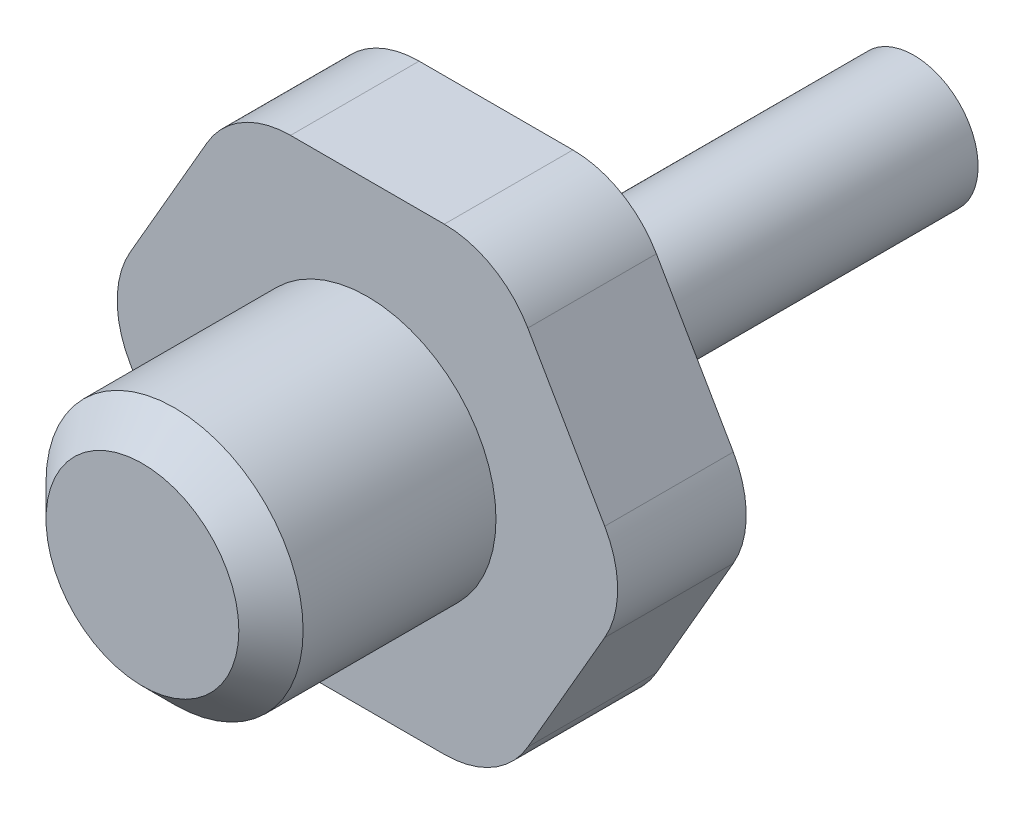
ISO-10303-21;
HEADER;
FILE_DESCRIPTION(('STEP AP214'),'2;1');
FILE_NAME('part.step','',(''),(''),'','','');
FILE_SCHEMA(('AUTOMOTIVE_DESIGN { 1 0 10303 214 1 1 1 1 }'));
ENDSEC;
DATA;
#1=APPLICATION_CONTEXT('core data for automotive mechanical design processes');
#2=APPLICATION_PROTOCOL_DEFINITION('international standard','automotive_design',2000,#1);
#3=PRODUCT_CONTEXT('',#1,'mechanical');
#4=PRODUCT('Part','Part','',(#3));
#5=PRODUCT_RELATED_PRODUCT_CATEGORY('part','',(#4));
#6=PRODUCT_DEFINITION_FORMATION('','',#4);
#7=PRODUCT_DEFINITION_CONTEXT('part definition',#1,'design');
#8=PRODUCT_DEFINITION('design','',#6,#7);
#9=PRODUCT_DEFINITION_SHAPE('','',#8);
#10=(LENGTH_UNIT() NAMED_UNIT(*) SI_UNIT(.MILLI.,.METRE.));
#11=(NAMED_UNIT(*) PLANE_ANGLE_UNIT() SI_UNIT($,.RADIAN.));
#12=(NAMED_UNIT(*) SI_UNIT($,.STERADIAN.) SOLID_ANGLE_UNIT());
#13=UNCERTAINTY_MEASURE_WITH_UNIT(LENGTH_MEASURE(1.E-05),#10,'distance_accuracy_value','');
#14=(GEOMETRIC_REPRESENTATION_CONTEXT(3) GLOBAL_UNCERTAINTY_ASSIGNED_CONTEXT((#13)) GLOBAL_UNIT_ASSIGNED_CONTEXT((#10,
#11,#12)) REPRESENTATION_CONTEXT('',''));
#15=CARTESIAN_POINT('',(0.,0.,0.));
#16=DIRECTION('',(0.,0.,1.));
#17=DIRECTION('',(1.,0.,0.));
#18=AXIS2_PLACEMENT_3D('',#15,#16,#17);
#19=CARTESIAN_POINT('',(0.,0.,-3.));
#20=DIRECTION('',(0.,0.,-1.));
#21=DIRECTION('',(-1.,0.,0.));
#22=AXIS2_PLACEMENT_3D('',#19,#20,#21);
#23=PLANE('',#22);
#24=CARTESIAN_POINT('',(0.,0.,-3.));
#25=DIRECTION('',(0.,0.,-1.));
#26=DIRECTION('',(-1.,0.,0.));
#27=AXIS2_PLACEMENT_3D('',#24,#25,#26);
#28=CIRCLE('',#27,2.375);
#29=CARTESIAN_POINT('',(-2.375,0.,-3.));
#30=VERTEX_POINT('',#29);
#31=EDGE_CURVE('E156',#30,#30,#28,.T.);
#32=ORIENTED_EDGE('',*,*,#31,.T.);
#33=EDGE_LOOP('',(#32));
#34=FACE_BOUND('',#33,.T.);
#35=CARTESIAN_POINT('',(0.,0.,-3.));
#36=DIRECTION('',(0.,0.,-1.));
#37=DIRECTION('',(-1.,0.,0.));
#38=AXIS2_PLACEMENT_3D('',#35,#36,#37);
#39=CIRCLE('',#38,2.);
#40=CARTESIAN_POINT('',(-2.,0.,-3.));
#41=VERTEX_POINT('',#40);
#42=EDGE_CURVE('E326',#41,#41,#39,.T.);
#43=ORIENTED_EDGE('',*,*,#42,.F.);
#44=EDGE_LOOP('',(#43));
#45=FACE_BOUND('',#44,.T.);
#46=ADVANCED_FACE('F32',(#34,#45),#23,.T.);
#47=CARTESIAN_POINT('',(8.24889197104678,0.,0.));
#48=DIRECTION('',(0.,0.,1.));
#49=DIRECTION('',(1.,0.,0.));
#50=AXIS2_PLACEMENT_3D('',#47,#48,#49);
#51=PLANE('',#50);
#52=CARTESIAN_POINT('',(0.,0.,0.));
#53=DIRECTION('',(0.,0.,1.));
#54=DIRECTION('',(1.,0.,0.));
#55=AXIS2_PLACEMENT_3D('',#52,#53,#54);
#56=CIRCLE('',#55,3.375);
#57=CARTESIAN_POINT('',(3.375,0.,0.));
#58=VERTEX_POINT('',#57);
#59=EDGE_CURVE('E11',#58,#58,#56,.T.);
#60=ORIENTED_EDGE('',*,*,#59,.T.);
#61=EDGE_LOOP('',(#60));
#62=FACE_BOUND('',#61,.T.);
#63=DIRECTION('',(0.5,0.866025403784439,0.));
#64=VECTOR('',#63,1.);
#65=CARTESIAN_POINT('',(4.12444598552338,-7.14375000000001,0.));
#66=LINE('',#65,#64);
#67=CARTESIAN_POINT('',(4.99047138930782,-5.64375000000001,0.));
#68=VERTEX_POINT('',#67);
#69=CARTESIAN_POINT('',(7.38286656726234,-1.5,0.));
#70=VERTEX_POINT('',#69);
#71=EDGE_CURVE('E140',#68,#70,#66,.T.);
#72=ORIENTED_EDGE('',*,*,#71,.F.);
#73=CARTESIAN_POINT('',(2.39239517795451,-4.14375000000001,0.));
#74=DIRECTION('',(0.,0.,1.));
#75=DIRECTION('',(1.,0.,0.));
#76=AXIS2_PLACEMENT_3D('',#73,#74,#75);
#77=CIRCLE('',#76,3.);
#78=CARTESIAN_POINT('',(2.39239517795451,-7.14375000000001,0.));
#79=VERTEX_POINT('',#78);
#80=EDGE_CURVE('E123',#68,#79,#77,.F.);
#81=ORIENTED_EDGE('',*,*,#80,.T.);
#82=DIRECTION('',(1.,0.,0.));
#83=VECTOR('',#82,1.);
#84=CARTESIAN_POINT('',(-4.1244459855234,-7.14375000000001,0.));
#85=LINE('',#84,#83);
#86=CARTESIAN_POINT('',(-2.39239517795452,-7.14375000000001,0.));
#87=VERTEX_POINT('',#86);
#88=EDGE_CURVE('E169',#87,#79,#85,.T.);
#89=ORIENTED_EDGE('',*,*,#88,.F.);
#90=CARTESIAN_POINT('',(-2.39239517795452,-4.14375000000001,0.));
#91=DIRECTION('',(0.,0.,1.));
#92=DIRECTION('',(1.,0.,0.));
#93=AXIS2_PLACEMENT_3D('',#90,#91,#92);
#94=CIRCLE('',#93,3.);
#95=CARTESIAN_POINT('',(-4.99047138930783,-5.64375,0.));
#96=VERTEX_POINT('',#95);
#97=EDGE_CURVE('E183',#87,#96,#94,.F.);
#98=ORIENTED_EDGE('',*,*,#97,.T.);
#99=DIRECTION('',(0.5,-0.866025403784439,0.));
#100=VECTOR('',#99,1.);
#101=CARTESIAN_POINT('',(-8.24889197104679,0.,0.));
#102=LINE('',#101,#100);
#103=CARTESIAN_POINT('',(-7.38286656726235,-1.5,0.));
#104=VERTEX_POINT('',#103);
#105=EDGE_CURVE('E167',#104,#96,#102,.T.);
#106=ORIENTED_EDGE('',*,*,#105,.F.);
#107=CARTESIAN_POINT('',(-4.78479035590903,0.,0.));
#108=DIRECTION('',(0.,0.,1.));
#109=DIRECTION('',(1.,0.,0.));
#110=AXIS2_PLACEMENT_3D('',#107,#108,#109);
#111=CIRCLE('',#110,3.);
#112=CARTESIAN_POINT('',(-7.38286656726235,1.5,0.));
#113=VERTEX_POINT('',#112);
#114=EDGE_CURVE('E181',#104,#113,#111,.F.);
#115=ORIENTED_EDGE('',*,*,#114,.T.);
#116=DIRECTION('',(-0.5,-0.866025403784439,0.));
#117=VECTOR('',#116,1.);
#118=CARTESIAN_POINT('',(-4.12444598552339,7.14375000000001,0.));
#119=LINE('',#118,#117);
#120=CARTESIAN_POINT('',(-4.99047138930783,5.64375000000001,0.));
#121=VERTEX_POINT('',#120);
#122=EDGE_CURVE('E164',#121,#113,#119,.T.);
#123=ORIENTED_EDGE('',*,*,#122,.F.);
#124=CARTESIAN_POINT('',(-2.39239517795452,4.14375000000001,0.));
#125=DIRECTION('',(0.,0.,1.));
#126=DIRECTION('',(1.,0.,0.));
#127=AXIS2_PLACEMENT_3D('',#124,#125,#126);
#128=CIRCLE('',#127,3.);
#129=CARTESIAN_POINT('',(-2.39239517795452,7.14375000000001,0.));
#130=VERTEX_POINT('',#129);
#131=EDGE_CURVE('E179',#121,#130,#128,.F.);
#132=ORIENTED_EDGE('',*,*,#131,.T.);
#133=DIRECTION('',(-1.,0.,0.));
#134=VECTOR('',#133,1.);
#135=CARTESIAN_POINT('',(4.12444598552338,7.14375000000001,0.));
#136=LINE('',#135,#134);
#137=CARTESIAN_POINT('',(2.3923951779545,7.14375000000001,0.));
#138=VERTEX_POINT('',#137);
#139=EDGE_CURVE('E153',#138,#130,#136,.T.);
#140=ORIENTED_EDGE('',*,*,#139,.F.);
#141=CARTESIAN_POINT('',(2.3923951779545,4.14375000000001,0.));
#142=DIRECTION('',(0.,0.,1.));
#143=DIRECTION('',(1.,0.,0.));
#144=AXIS2_PLACEMENT_3D('',#141,#142,#143);
#145=CIRCLE('',#144,3.);
#146=CARTESIAN_POINT('',(4.99047138930782,5.64375000000001,0.));
#147=VERTEX_POINT('',#146);
#148=EDGE_CURVE('E144',#138,#147,#145,.F.);
#149=ORIENTED_EDGE('',*,*,#148,.T.);
#150=DIRECTION('',(-0.5,0.866025403784439,0.));
#151=VECTOR('',#150,1.);
#152=CARTESIAN_POINT('',(8.24889197104678,0.,0.));
#153=LINE('',#152,#151);
#154=CARTESIAN_POINT('',(7.38286656726234,1.5,0.));
#155=VERTEX_POINT('',#154);
#156=EDGE_CURVE('E149',#155,#147,#153,.T.);
#157=ORIENTED_EDGE('',*,*,#156,.F.);
#158=CARTESIAN_POINT('',(4.78479035590902,0.,0.));
#159=DIRECTION('',(0.,0.,1.));
#160=DIRECTION('',(1.,0.,0.));
#161=AXIS2_PLACEMENT_3D('',#158,#159,#160);
#162=CIRCLE('',#161,3.);
#163=EDGE_CURVE('E134',#155,#70,#162,.F.);
#164=ORIENTED_EDGE('',*,*,#163,.T.);
#165=EDGE_LOOP('',(#72,#81,#89,#98,#106,#115,#123,#132,#140,#149,#157,#164));
#166=FACE_BOUND('',#165,.T.);
#167=ADVANCED_FACE('F147',(#62,#166),#51,.F.);
#168=CARTESIAN_POINT('',(8.24889197104678,0.,4.));
#169=DIRECTION('',(0.,0.,1.));
#170=DIRECTION('',(1.,0.,0.));
#171=AXIS2_PLACEMENT_3D('',#168,#169,#170);
#172=PLANE('',#171);
#173=DIRECTION('',(1.,0.,0.));
#174=VECTOR('',#173,1.);
#175=CARTESIAN_POINT('',(-4.1244459855234,-7.14375000000001,4.));
#176=LINE('',#175,#174);
#177=CARTESIAN_POINT('',(-2.39239517795452,-7.14375000000001,4.));
#178=VERTEX_POINT('',#177);
#179=CARTESIAN_POINT('',(2.39239517795451,-7.14375000000001,4.));
#180=VERTEX_POINT('',#179);
#181=EDGE_CURVE('E159',#178,#180,#176,.T.);
#182=ORIENTED_EDGE('',*,*,#181,.T.);
#183=CARTESIAN_POINT('',(2.39239517795451,-4.14375000000001,4.));
#184=DIRECTION('',(0.,0.,1.));
#185=DIRECTION('',(1.,0.,0.));
#186=AXIS2_PLACEMENT_3D('',#183,#184,#185);
#187=CIRCLE('',#186,3.);
#188=CARTESIAN_POINT('',(4.99047138930782,-5.64375000000001,4.));
#189=VERTEX_POINT('',#188);
#190=EDGE_CURVE('E198',#180,#189,#187,.T.);
#191=ORIENTED_EDGE('',*,*,#190,.T.);
#192=DIRECTION('',(0.5,0.866025403784439,0.));
#193=VECTOR('',#192,1.);
#194=CARTESIAN_POINT('',(4.12444598552338,-7.14375000000001,4.));
#195=LINE('',#194,#193);
#196=CARTESIAN_POINT('',(7.38286656726234,-1.5,4.));
#197=VERTEX_POINT('',#196);
#198=EDGE_CURVE('E143',#189,#197,#195,.T.);
#199=ORIENTED_EDGE('',*,*,#198,.T.);
#200=CARTESIAN_POINT('',(4.78479035590902,0.,4.));
#201=DIRECTION('',(0.,0.,1.));
#202=DIRECTION('',(1.,0.,0.));
#203=AXIS2_PLACEMENT_3D('',#200,#201,#202);
#204=CIRCLE('',#203,3.);
#205=CARTESIAN_POINT('',(7.38286656726234,1.5,4.));
#206=VERTEX_POINT('',#205);
#207=EDGE_CURVE('E196',#197,#206,#204,.T.);
#208=ORIENTED_EDGE('',*,*,#207,.T.);
#209=DIRECTION('',(-0.5,0.866025403784439,0.));
#210=VECTOR('',#209,1.);
#211=CARTESIAN_POINT('',(8.24889197104678,0.,4.));
#212=LINE('',#211,#210);
#213=CARTESIAN_POINT('',(4.99047138930782,5.64375000000001,4.));
#214=VERTEX_POINT('',#213);
#215=EDGE_CURVE('E318',#206,#214,#212,.T.);
#216=ORIENTED_EDGE('',*,*,#215,.T.);
#217=CARTESIAN_POINT('',(2.3923951779545,4.14375000000001,4.));
#218=DIRECTION('',(0.,0.,1.));
#219=DIRECTION('',(1.,0.,0.));
#220=AXIS2_PLACEMENT_3D('',#217,#218,#219);
#221=CIRCLE('',#220,3.);
#222=CARTESIAN_POINT('',(2.3923951779545,7.14375000000001,4.));
#223=VERTEX_POINT('',#222);
#224=EDGE_CURVE('E189',#214,#223,#221,.T.);
#225=ORIENTED_EDGE('',*,*,#224,.T.);
#226=DIRECTION('',(-1.,0.,0.));
#227=VECTOR('',#226,1.);
#228=CARTESIAN_POINT('',(4.12444598552338,7.14375000000001,4.));
#229=LINE('',#228,#227);
#230=CARTESIAN_POINT('',(-2.39239517795452,7.14375000000001,4.));
#231=VERTEX_POINT('',#230);
#232=EDGE_CURVE('E313',#223,#231,#229,.T.);
#233=ORIENTED_EDGE('',*,*,#232,.T.);
#234=CARTESIAN_POINT('',(-2.39239517795452,4.14375000000001,4.));
#235=DIRECTION('',(0.,0.,1.));
#236=DIRECTION('',(1.,0.,0.));
#237=AXIS2_PLACEMENT_3D('',#234,#235,#236);
#238=CIRCLE('',#237,3.);
#239=CARTESIAN_POINT('',(-4.99047138930783,5.64375000000001,4.));
#240=VERTEX_POINT('',#239);
#241=EDGE_CURVE('E191',#231,#240,#238,.T.);
#242=ORIENTED_EDGE('',*,*,#241,.T.);
#243=DIRECTION('',(-0.5,-0.866025403784439,0.));
#244=VECTOR('',#243,1.);
#245=CARTESIAN_POINT('',(-4.12444598552339,7.14375000000001,4.));
#246=LINE('',#245,#244);
#247=CARTESIAN_POINT('',(-7.38286656726235,1.5,4.));
#248=VERTEX_POINT('',#247);
#249=EDGE_CURVE('E311',#240,#248,#246,.T.);
#250=ORIENTED_EDGE('',*,*,#249,.T.);
#251=CARTESIAN_POINT('',(-4.78479035590903,0.,4.));
#252=DIRECTION('',(0.,0.,1.));
#253=DIRECTION('',(1.,0.,0.));
#254=AXIS2_PLACEMENT_3D('',#251,#252,#253);
#255=CIRCLE('',#254,3.);
#256=CARTESIAN_POINT('',(-7.38286656726235,-1.5,4.));
#257=VERTEX_POINT('',#256);
#258=EDGE_CURVE('E54',#248,#257,#255,.T.);
#259=ORIENTED_EDGE('',*,*,#258,.T.);
#260=DIRECTION('',(0.5,-0.866025403784439,0.));
#261=VECTOR('',#260,1.);
#262=CARTESIAN_POINT('',(-8.24889197104679,0.,4.));
#263=LINE('',#262,#261);
#264=CARTESIAN_POINT('',(-4.99047138930783,-5.64375,4.));
#265=VERTEX_POINT('',#264);
#266=EDGE_CURVE('E316',#257,#265,#263,.T.);
#267=ORIENTED_EDGE('',*,*,#266,.T.);
#268=CARTESIAN_POINT('',(-2.39239517795452,-4.14375000000001,4.));
#269=DIRECTION('',(0.,0.,1.));
#270=DIRECTION('',(1.,0.,0.));
#271=AXIS2_PLACEMENT_3D('',#268,#269,#270);
#272=CIRCLE('',#271,3.);
#273=EDGE_CURVE('E194',#265,#178,#272,.T.);
#274=ORIENTED_EDGE('',*,*,#273,.T.);
#275=EDGE_LOOP('',(#182,#191,#199,#208,#216,#225,#233,#242,#250,#259,#267,#274));
#276=FACE_BOUND('',#275,.T.);
#277=CARTESIAN_POINT('',(0.,0.,4.));
#278=DIRECTION('',(0.,0.,1.));
#279=DIRECTION('',(1.,0.,0.));
#280=AXIS2_PLACEMENT_3D('',#277,#278,#279);
#281=CIRCLE('',#280,4.);
#282=CARTESIAN_POINT('',(4.,0.,4.));
#283=VERTEX_POINT('',#282);
#284=EDGE_CURVE('E150',#283,#283,#281,.T.);
#285=ORIENTED_EDGE('',*,*,#284,.F.);
#286=EDGE_LOOP('',(#285));
#287=FACE_BOUND('',#286,.T.);
#288=ADVANCED_FACE('F239',(#276,#287),#172,.T.);
#289=CARTESIAN_POINT('',(4.12444598552338,-7.14375000000001,4.));
#290=DIRECTION('',(-0.866025403784439,0.5,0.));
#291=DIRECTION('',(-0.5,-0.866025403784439,0.));
#292=AXIS2_PLACEMENT_3D('',#289,#290,#291);
#293=PLANE('',#292);
#294=ORIENTED_EDGE('',*,*,#198,.F.);
#295=DIRECTION('',(0.,0.,-1.));
#296=VECTOR('',#295,1.);
#297=CARTESIAN_POINT('',(4.99047138930782,-5.64375000000001,4.));
#298=LINE('',#297,#296);
#299=EDGE_CURVE('E127',#189,#68,#298,.T.);
#300=ORIENTED_EDGE('',*,*,#299,.T.);
#301=ORIENTED_EDGE('',*,*,#71,.T.);
#302=DIRECTION('',(0.,0.,-1.));
#303=VECTOR('',#302,1.);
#304=CARTESIAN_POINT('',(7.38286656726234,-1.5,4.));
#305=LINE('',#304,#303);
#306=EDGE_CURVE('E145',#70,#197,#305,.F.);
#307=ORIENTED_EDGE('',*,*,#306,.T.);
#308=EDGE_LOOP('',(#294,#300,#301,#307));
#309=FACE_BOUND('',#308,.T.);
#310=ADVANCED_FACE('F139',(#309),#293,.F.);
#311=CARTESIAN_POINT('',(8.24889197104678,0.,4.));
#312=DIRECTION('',(-0.866025403784439,-0.5,0.));
#313=DIRECTION('',(0.5,-0.866025403784439,0.));
#314=AXIS2_PLACEMENT_3D('',#311,#312,#313);
#315=PLANE('',#314);
#316=ORIENTED_EDGE('',*,*,#215,.F.);
#317=DIRECTION('',(0.,0.,-1.));
#318=VECTOR('',#317,1.);
#319=CARTESIAN_POINT('',(7.38286656726234,1.5,4.));
#320=LINE('',#319,#318);
#321=EDGE_CURVE('E202',#206,#155,#320,.T.);
#322=ORIENTED_EDGE('',*,*,#321,.T.);
#323=ORIENTED_EDGE('',*,*,#156,.T.);
#324=DIRECTION('',(0.,0.,-1.));
#325=VECTOR('',#324,1.);
#326=CARTESIAN_POINT('',(4.99047138930782,5.64375000000001,4.));
#327=LINE('',#326,#325);
#328=EDGE_CURVE('E200',#147,#214,#327,.F.);
#329=ORIENTED_EDGE('',*,*,#328,.T.);
#330=EDGE_LOOP('',(#316,#322,#323,#329));
#331=FACE_BOUND('',#330,.T.);
#332=ADVANCED_FACE('F275',(#331),#315,.F.);
#333=CARTESIAN_POINT('',(4.12444598552338,7.14375000000001,4.));
#334=DIRECTION('',(0.,-1.,0.));
#335=DIRECTION('',(1.,0.,0.));
#336=AXIS2_PLACEMENT_3D('',#333,#334,#335);
#337=PLANE('',#336);
#338=ORIENTED_EDGE('',*,*,#139,.T.);
#339=DIRECTION('',(0.,0.,-1.));
#340=VECTOR('',#339,1.);
#341=CARTESIAN_POINT('',(-2.39239517795452,7.14375000000001,4.));
#342=LINE('',#341,#340);
#343=EDGE_CURVE('E217',#130,#231,#342,.F.);
#344=ORIENTED_EDGE('',*,*,#343,.T.);
#345=ORIENTED_EDGE('',*,*,#232,.F.);
#346=DIRECTION('',(0.,0.,-1.));
#347=VECTOR('',#346,1.);
#348=CARTESIAN_POINT('',(2.3923951779545,7.14375000000001,4.));
#349=LINE('',#348,#347);
#350=EDGE_CURVE('E214',#223,#138,#349,.T.);
#351=ORIENTED_EDGE('',*,*,#350,.T.);
#352=EDGE_LOOP('',(#338,#344,#345,#351));
#353=FACE_BOUND('',#352,.T.);
#354=ADVANCED_FACE('F271',(#353),#337,.F.);
#355=CARTESIAN_POINT('',(-4.12444598552339,7.14375000000001,4.));
#356=DIRECTION('',(0.866025403784439,-0.5,0.));
#357=DIRECTION('',(0.5,0.866025403784439,0.));
#358=AXIS2_PLACEMENT_3D('',#355,#356,#357);
#359=PLANE('',#358);
#360=ORIENTED_EDGE('',*,*,#122,.T.);
#361=DIRECTION('',(0.,0.,-1.));
#362=VECTOR('',#361,1.);
#363=CARTESIAN_POINT('',(-7.38286656726235,1.5,4.));
#364=LINE('',#363,#362);
#365=EDGE_CURVE('E212',#113,#248,#364,.F.);
#366=ORIENTED_EDGE('',*,*,#365,.T.);
#367=ORIENTED_EDGE('',*,*,#249,.F.);
#368=DIRECTION('',(0.,0.,-1.));
#369=VECTOR('',#368,1.);
#370=CARTESIAN_POINT('',(-4.99047138930783,5.64375000000001,4.));
#371=LINE('',#370,#369);
#372=EDGE_CURVE('E209',#240,#121,#371,.T.);
#373=ORIENTED_EDGE('',*,*,#372,.T.);
#374=EDGE_LOOP('',(#360,#366,#367,#373));
#375=FACE_BOUND('',#374,.T.);
#376=ADVANCED_FACE('F268',(#375),#359,.F.);
#377=CARTESIAN_POINT('',(-8.24889197104679,0.,4.));
#378=DIRECTION('',(0.866025403784439,0.5,0.));
#379=DIRECTION('',(-0.5,0.866025403784439,0.));
#380=AXIS2_PLACEMENT_3D('',#377,#378,#379);
#381=PLANE('',#380);
#382=ORIENTED_EDGE('',*,*,#105,.T.);
#383=DIRECTION('',(0.,0.,-1.));
#384=VECTOR('',#383,1.);
#385=CARTESIAN_POINT('',(-4.99047138930783,-5.64375,4.));
#386=LINE('',#385,#384);
#387=EDGE_CURVE('E47',#96,#265,#386,.F.);
#388=ORIENTED_EDGE('',*,*,#387,.T.);
#389=ORIENTED_EDGE('',*,*,#266,.F.);
#390=DIRECTION('',(0.,0.,-1.));
#391=VECTOR('',#390,1.);
#392=CARTESIAN_POINT('',(-7.38286656726235,-1.5,4.));
#393=LINE('',#392,#391);
#394=EDGE_CURVE('E205',#257,#104,#393,.T.);
#395=ORIENTED_EDGE('',*,*,#394,.T.);
#396=EDGE_LOOP('',(#382,#388,#389,#395));
#397=FACE_BOUND('',#396,.T.);
#398=ADVANCED_FACE('F264',(#397),#381,.F.);
#399=CARTESIAN_POINT('',(-4.1244459855234,-7.14375000000001,4.));
#400=DIRECTION('',(0.,1.,0.));
#401=DIRECTION('',(-1.,0.,0.));
#402=AXIS2_PLACEMENT_3D('',#399,#400,#401);
#403=PLANE('',#402);
#404=ORIENTED_EDGE('',*,*,#88,.T.);
#405=DIRECTION('',(0.,0.,-1.));
#406=VECTOR('',#405,1.);
#407=CARTESIAN_POINT('',(2.39239517795451,-7.14375000000001,4.));
#408=LINE('',#407,#406);
#409=EDGE_CURVE('E128',#79,#180,#408,.F.);
#410=ORIENTED_EDGE('',*,*,#409,.T.);
#411=ORIENTED_EDGE('',*,*,#181,.F.);
#412=DIRECTION('',(0.,0.,-1.));
#413=VECTOR('',#412,1.);
#414=CARTESIAN_POINT('',(-2.39239517795452,-7.14375000000001,4.));
#415=LINE('',#414,#413);
#416=EDGE_CURVE('E133',#178,#87,#415,.T.);
#417=ORIENTED_EDGE('',*,*,#416,.T.);
#418=EDGE_LOOP('',(#404,#410,#411,#417));
#419=FACE_BOUND('',#418,.T.);
#420=ADVANCED_FACE('F258',(#419),#403,.F.);
#421=CARTESIAN_POINT('',(0.,0.,11.));
#422=DIRECTION('',(0.,0.,-1.));
#423=DIRECTION('',(-1.,0.,0.));
#424=AXIS2_PLACEMENT_3D('',#421,#422,#423);
#425=CYLINDRICAL_SURFACE('',#424,4.);
#426=CARTESIAN_POINT('',(0.,0.,9.99999999999999));
#427=DIRECTION('',(0.,0.,1.));
#428=DIRECTION('',(1.,0.,0.));
#429=AXIS2_PLACEMENT_3D('',#426,#427,#428);
#430=CIRCLE('',#429,4.);
#431=CARTESIAN_POINT('',(4.,0.,9.99999999999999));
#432=VERTEX_POINT('',#431);
#433=EDGE_CURVE('E174',#432,#432,#430,.F.);
#434=ORIENTED_EDGE('',*,*,#433,.T.);
#435=EDGE_LOOP('',(#434));
#436=FACE_BOUND('',#435,.T.);
#437=ORIENTED_EDGE('',*,*,#284,.T.);
#438=EDGE_LOOP('',(#437));
#439=FACE_BOUND('',#438,.T.);
#440=ADVANCED_FACE('F254',(#436,#439),#425,.T.);
#441=CARTESIAN_POINT('',(0.,0.,11.));
#442=DIRECTION('',(0.,0.,1.));
#443=DIRECTION('',(1.,0.,0.));
#444=AXIS2_PLACEMENT_3D('',#441,#442,#443);
#445=PLANE('',#444);
#446=CARTESIAN_POINT('',(0.,0.,11.));
#447=DIRECTION('',(0.,0.,1.));
#448=DIRECTION('',(1.,0.,0.));
#449=AXIS2_PLACEMENT_3D('',#446,#447,#448);
#450=CIRCLE('',#449,3.);
#451=CARTESIAN_POINT('',(3.,0.,11.));
#452=VERTEX_POINT('',#451);
#453=EDGE_CURVE('E171',#452,#452,#450,.T.);
#454=ORIENTED_EDGE('',*,*,#453,.T.);
#455=EDGE_LOOP('',(#454));
#456=FACE_BOUND('',#455,.T.);
#457=ADVANCED_FACE('F251',(#456),#445,.T.);
#458=CARTESIAN_POINT('',(0.,0.,11.));
#459=DIRECTION('',(0.,0.,-1.));
#460=DIRECTION('',(-1.,0.,0.));
#461=AXIS2_PLACEMENT_3D('',#458,#459,#460);
#462=CONICAL_SURFACE('',#461,3.,0.785398163397448);
#463=ORIENTED_EDGE('',*,*,#433,.F.);
#464=EDGE_LOOP('',(#463));
#465=FACE_BOUND('',#464,.T.);
#466=ORIENTED_EDGE('',*,*,#453,.F.);
#467=EDGE_LOOP('',(#466));
#468=FACE_BOUND('',#467,.T.);
#469=ADVANCED_FACE('F250',(#465,#468),#462,.T.);
#470=CARTESIAN_POINT('',(0.,0.,-3.));
#471=DIRECTION('',(0.,0.,1.));
#472=DIRECTION('',(1.,0.,0.));
#473=AXIS2_PLACEMENT_3D('',#470,#471,#472);
#474=CYLINDRICAL_SURFACE('',#473,2.375);
#475=CARTESIAN_POINT('',(0.,0.,-1.));
#476=DIRECTION('',(0.,0.,1.));
#477=DIRECTION('',(1.,0.,0.));
#478=AXIS2_PLACEMENT_3D('',#475,#476,#477);
#479=CIRCLE('',#478,2.375);
#480=CARTESIAN_POINT('',(2.375,0.,-1.));
#481=VERTEX_POINT('',#480);
#482=EDGE_CURVE('E40',#481,#481,#479,.F.);
#483=ORIENTED_EDGE('',*,*,#482,.T.);
#484=EDGE_LOOP('',(#483));
#485=FACE_BOUND('',#484,.T.);
#486=ORIENTED_EDGE('',*,*,#31,.F.);
#487=EDGE_LOOP('',(#486));
#488=FACE_BOUND('',#487,.T.);
#489=ADVANCED_FACE('F221',(#485,#488),#474,.T.);
#490=CARTESIAN_POINT('',(0.,0.,-13.));
#491=DIRECTION('',(0.,0.,1.));
#492=DIRECTION('',(1.,0.,0.));
#493=AXIS2_PLACEMENT_3D('',#490,#491,#492);
#494=CYLINDRICAL_SURFACE('',#493,2.);
#495=CARTESIAN_POINT('',(0.,0.,-13.));
#496=DIRECTION('',(0.,0.,-1.));
#497=DIRECTION('',(-1.,0.,0.));
#498=AXIS2_PLACEMENT_3D('',#495,#496,#497);
#499=CIRCLE('',#498,2.);
#500=CARTESIAN_POINT('',(-2.,0.,-13.));
#501=VERTEX_POINT('',#500);
#502=EDGE_CURVE('E325',#501,#501,#499,.T.);
#503=ORIENTED_EDGE('',*,*,#502,.F.);
#504=EDGE_LOOP('',(#503));
#505=FACE_BOUND('',#504,.T.);
#506=ORIENTED_EDGE('',*,*,#42,.T.);
#507=EDGE_LOOP('',(#506));
#508=FACE_BOUND('',#507,.T.);
#509=ADVANCED_FACE('F246',(#505,#508),#494,.T.);
#510=CARTESIAN_POINT('',(0.,0.,-13.));
#511=DIRECTION('',(0.,0.,-1.));
#512=DIRECTION('',(-1.,0.,0.));
#513=AXIS2_PLACEMENT_3D('',#510,#511,#512);
#514=PLANE('',#513);
#515=ORIENTED_EDGE('',*,*,#502,.T.);
#516=EDGE_LOOP('',(#515));
#517=FACE_BOUND('',#516,.T.);
#518=ADVANCED_FACE('F288',(#517),#514,.T.);
#519=CARTESIAN_POINT('',(2.39239517795451,-4.14375000000001,4.));
#520=DIRECTION('',(0.,0.,-1.));
#521=DIRECTION('',(-1.,0.,0.));
#522=AXIS2_PLACEMENT_3D('',#519,#520,#521);
#523=CYLINDRICAL_SURFACE('',#522,3.);
#524=ORIENTED_EDGE('',*,*,#190,.F.);
#525=ORIENTED_EDGE('',*,*,#409,.F.);
#526=ORIENTED_EDGE('',*,*,#80,.F.);
#527=ORIENTED_EDGE('',*,*,#299,.F.);
#528=EDGE_LOOP('',(#524,#525,#526,#527));
#529=FACE_BOUND('',#528,.T.);
#530=ADVANCED_FACE('F126',(#529),#523,.T.);
#531=CARTESIAN_POINT('',(4.78479035590902,0.,4.));
#532=DIRECTION('',(0.,0.,-1.));
#533=DIRECTION('',(-1.,0.,0.));
#534=AXIS2_PLACEMENT_3D('',#531,#532,#533);
#535=CYLINDRICAL_SURFACE('',#534,3.);
#536=ORIENTED_EDGE('',*,*,#207,.F.);
#537=ORIENTED_EDGE('',*,*,#306,.F.);
#538=ORIENTED_EDGE('',*,*,#163,.F.);
#539=ORIENTED_EDGE('',*,*,#321,.F.);
#540=EDGE_LOOP('',(#536,#537,#538,#539));
#541=FACE_BOUND('',#540,.T.);
#542=ADVANCED_FACE('F287',(#541),#535,.T.);
#543=CARTESIAN_POINT('',(-2.39239517795452,-4.14375000000001,4.));
#544=DIRECTION('',(0.,0.,-1.));
#545=DIRECTION('',(-1.,0.,0.));
#546=AXIS2_PLACEMENT_3D('',#543,#544,#545);
#547=CYLINDRICAL_SURFACE('',#546,3.);
#548=ORIENTED_EDGE('',*,*,#273,.F.);
#549=ORIENTED_EDGE('',*,*,#387,.F.);
#550=ORIENTED_EDGE('',*,*,#97,.F.);
#551=ORIENTED_EDGE('',*,*,#416,.F.);
#552=EDGE_LOOP('',(#548,#549,#550,#551));
#553=FACE_BOUND('',#552,.T.);
#554=ADVANCED_FACE('F291',(#553),#547,.T.);
#555=CARTESIAN_POINT('',(-4.78479035590903,0.,4.));
#556=DIRECTION('',(0.,0.,-1.));
#557=DIRECTION('',(-1.,0.,0.));
#558=AXIS2_PLACEMENT_3D('',#555,#556,#557);
#559=CYLINDRICAL_SURFACE('',#558,3.);
#560=ORIENTED_EDGE('',*,*,#258,.F.);
#561=ORIENTED_EDGE('',*,*,#365,.F.);
#562=ORIENTED_EDGE('',*,*,#114,.F.);
#563=ORIENTED_EDGE('',*,*,#394,.F.);
#564=EDGE_LOOP('',(#560,#561,#562,#563));
#565=FACE_BOUND('',#564,.T.);
#566=ADVANCED_FACE('F295',(#565),#559,.T.);
#567=CARTESIAN_POINT('',(-2.39239517795452,4.14375000000001,4.));
#568=DIRECTION('',(0.,0.,-1.));
#569=DIRECTION('',(-1.,0.,0.));
#570=AXIS2_PLACEMENT_3D('',#567,#568,#569);
#571=CYLINDRICAL_SURFACE('',#570,3.);
#572=ORIENTED_EDGE('',*,*,#241,.F.);
#573=ORIENTED_EDGE('',*,*,#343,.F.);
#574=ORIENTED_EDGE('',*,*,#131,.F.);
#575=ORIENTED_EDGE('',*,*,#372,.F.);
#576=EDGE_LOOP('',(#572,#573,#574,#575));
#577=FACE_BOUND('',#576,.T.);
#578=ADVANCED_FACE('F230',(#577),#571,.T.);
#579=CARTESIAN_POINT('',(2.3923951779545,4.14375000000001,4.));
#580=DIRECTION('',(0.,0.,-1.));
#581=DIRECTION('',(-1.,0.,0.));
#582=AXIS2_PLACEMENT_3D('',#579,#580,#581);
#583=CYLINDRICAL_SURFACE('',#582,3.);
#584=ORIENTED_EDGE('',*,*,#224,.F.);
#585=ORIENTED_EDGE('',*,*,#328,.F.);
#586=ORIENTED_EDGE('',*,*,#148,.F.);
#587=ORIENTED_EDGE('',*,*,#350,.F.);
#588=EDGE_LOOP('',(#584,#585,#586,#587));
#589=FACE_BOUND('',#588,.T.);
#590=ADVANCED_FACE('F225',(#589),#583,.T.);
#591=CARTESIAN_POINT('',(0.,0.,-1.));
#592=DIRECTION('',(0.,0.,1.));
#593=DIRECTION('',(1.,0.,0.));
#594=AXIS2_PLACEMENT_3D('',#591,#592,#593);
#595=TOROIDAL_SURFACE('',#594,3.375,1.);
#596=ORIENTED_EDGE('',*,*,#59,.F.);
#597=EDGE_LOOP('',(#596));
#598=FACE_BOUND('',#597,.T.);
#599=ORIENTED_EDGE('',*,*,#482,.F.);
#600=EDGE_LOOP('',(#599));
#601=FACE_BOUND('',#600,.T.);
#602=ADVANCED_FACE('F34',(#598,#601),#595,.F.);
#603=CLOSED_SHELL('',(#46,#167,#288,#310,#332,#354,#376,#398,#420,#440,#457,#469,#489,#509,#518,
#530,#542,#554,#566,#578,#590,#602));
#604=MANIFOLD_SOLID_BREP('B2',#603);
#605=ADVANCED_BREP_SHAPE_REPRESENTATION('',(#18,#604),#14);
#606=SHAPE_DEFINITION_REPRESENTATION(#9,#605);
ENDSEC;
END-ISO-10303-21;
